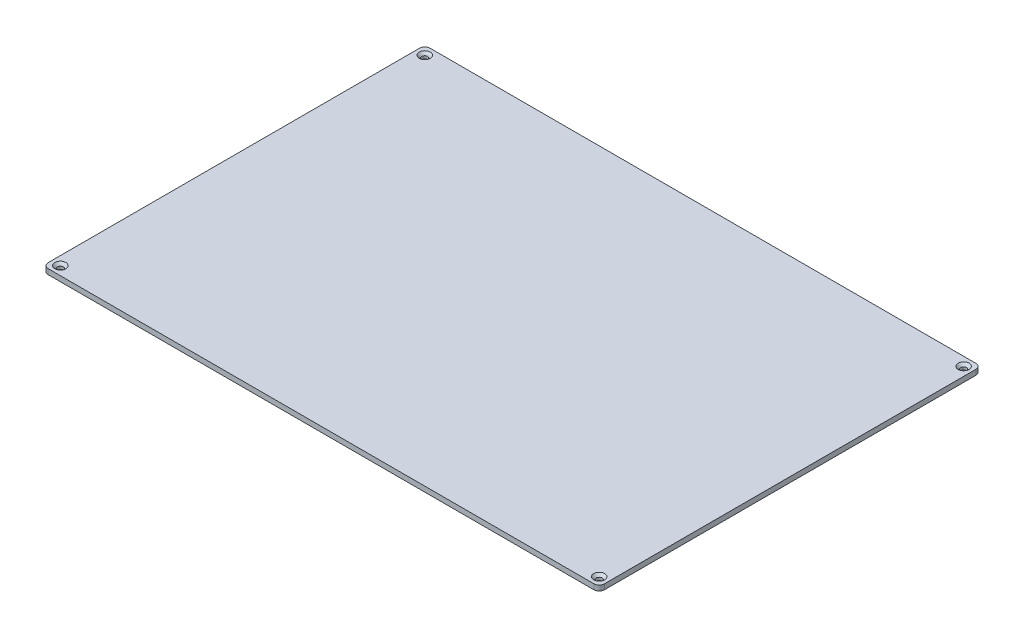
ISO-10303-21;
HEADER;
FILE_DESCRIPTION(('STEP AP214'),'2;1');
FILE_NAME('part.step','',(''),(''),'','','');
FILE_SCHEMA(('AUTOMOTIVE_DESIGN { 1 0 10303 214 1 1 1 1 }'));
ENDSEC;
DATA;
#1=APPLICATION_CONTEXT('core data for automotive mechanical design processes');
#2=APPLICATION_PROTOCOL_DEFINITION('international standard','automotive_design',2000,#1);
#3=PRODUCT_CONTEXT('',#1,'mechanical');
#4=PRODUCT('Part','Part','',(#3));
#5=PRODUCT_RELATED_PRODUCT_CATEGORY('part','',(#4));
#6=PRODUCT_DEFINITION_FORMATION('','',#4);
#7=PRODUCT_DEFINITION_CONTEXT('part definition',#1,'design');
#8=PRODUCT_DEFINITION('design','',#6,#7);
#9=PRODUCT_DEFINITION_SHAPE('','',#8);
#10=(LENGTH_UNIT() NAMED_UNIT(*) SI_UNIT(.MILLI.,.METRE.));
#11=(NAMED_UNIT(*) PLANE_ANGLE_UNIT() SI_UNIT($,.RADIAN.));
#12=(NAMED_UNIT(*) SI_UNIT($,.STERADIAN.) SOLID_ANGLE_UNIT());
#13=UNCERTAINTY_MEASURE_WITH_UNIT(LENGTH_MEASURE(1.E-05),#10,'distance_accuracy_value','');
#14=(GEOMETRIC_REPRESENTATION_CONTEXT(3) GLOBAL_UNCERTAINTY_ASSIGNED_CONTEXT((#13)) GLOBAL_UNIT_ASSIGNED_CONTEXT((#10,
#11,#12)) REPRESENTATION_CONTEXT('',''));
#15=CARTESIAN_POINT('',(0.,0.,0.));
#16=DIRECTION('',(0.,0.,1.));
#17=DIRECTION('',(1.,0.,0.));
#18=AXIS2_PLACEMENT_3D('',#15,#16,#17);
#19=CARTESIAN_POINT('',(156.5,0.,-106.5));
#20=DIRECTION('',(0.,-1.,0.));
#21=DIRECTION('',(0.,0.,-1.));
#22=AXIS2_PLACEMENT_3D('',#19,#20,#21);
#23=PLANE('',#22);
#24=CARTESIAN_POINT('',(-154.5,0.,104.5));
#25=DIRECTION('',(0.,1.,0.));
#26=DIRECTION('',(0.,0.,1.));
#27=AXIS2_PLACEMENT_3D('',#24,#25,#26);
#28=CIRCLE('',#27,1.70000000000001);
#29=CARTESIAN_POINT('',(-154.5,0.,106.2));
#30=VERTEX_POINT('',#29);
#31=EDGE_CURVE('E196',#30,#30,#28,.T.);
#32=ORIENTED_EDGE('',*,*,#31,.T.);
#33=EDGE_LOOP('',(#32));
#34=FACE_BOUND('',#33,.T.);
#35=CARTESIAN_POINT('',(156.5,0.,-106.5));
#36=DIRECTION('',(0.,1.,0.));
#37=DIRECTION('',(0.,0.,-1.));
#38=AXIS2_PLACEMENT_3D('',#35,#36,#37);
#39=CIRCLE('',#38,3.);
#40=CARTESIAN_POINT('',(159.5,0.,-106.5));
#41=VERTEX_POINT('',#40);
#42=CARTESIAN_POINT('',(156.5,0.,-109.5));
#43=VERTEX_POINT('',#42);
#44=EDGE_CURVE('E131',#41,#43,#39,.T.);
#45=ORIENTED_EDGE('',*,*,#44,.F.);
#46=DIRECTION('',(0.,0.,-1.));
#47=VECTOR('',#46,1.);
#48=CARTESIAN_POINT('',(159.5,0.,-106.5));
#49=LINE('',#48,#47);
#50=CARTESIAN_POINT('',(159.5,0.,106.5));
#51=VERTEX_POINT('',#50);
#52=EDGE_CURVE('E86',#51,#41,#49,.T.);
#53=ORIENTED_EDGE('',*,*,#52,.F.);
#54=CARTESIAN_POINT('',(156.5,0.,106.5));
#55=DIRECTION('',(0.,1.,0.));
#56=DIRECTION('',(0.,0.,1.));
#57=AXIS2_PLACEMENT_3D('',#54,#55,#56);
#58=CIRCLE('',#57,3.);
#59=CARTESIAN_POINT('',(156.5,0.,109.5));
#60=VERTEX_POINT('',#59);
#61=EDGE_CURVE('E80',#60,#51,#58,.T.);
#62=ORIENTED_EDGE('',*,*,#61,.F.);
#63=DIRECTION('',(1.,0.,0.));
#64=VECTOR('',#63,1.);
#65=CARTESIAN_POINT('',(-156.5,0.,109.5));
#66=LINE('',#65,#64);
#67=CARTESIAN_POINT('',(-156.5,0.,109.5));
#68=VERTEX_POINT('',#67);
#69=EDGE_CURVE('E121',#68,#60,#66,.T.);
#70=ORIENTED_EDGE('',*,*,#69,.F.);
#71=CARTESIAN_POINT('',(-156.5,0.,106.5));
#72=DIRECTION('',(0.,1.,0.));
#73=DIRECTION('',(0.,0.,1.));
#74=AXIS2_PLACEMENT_3D('',#71,#72,#73);
#75=CIRCLE('',#74,3.);
#76=CARTESIAN_POINT('',(-159.5,0.,106.5));
#77=VERTEX_POINT('',#76);
#78=EDGE_CURVE('E141',#77,#68,#75,.T.);
#79=ORIENTED_EDGE('',*,*,#78,.F.);
#80=DIRECTION('',(0.,0.,1.));
#81=VECTOR('',#80,1.);
#82=CARTESIAN_POINT('',(-159.5,0.,-106.5));
#83=LINE('',#82,#81);
#84=CARTESIAN_POINT('',(-159.5,0.,-106.5));
#85=VERTEX_POINT('',#84);
#86=EDGE_CURVE('E139',#85,#77,#83,.T.);
#87=ORIENTED_EDGE('',*,*,#86,.F.);
#88=CARTESIAN_POINT('',(-156.5,0.,-106.5));
#89=DIRECTION('',(0.,1.,0.));
#90=DIRECTION('',(0.,0.,1.));
#91=AXIS2_PLACEMENT_3D('',#88,#89,#90);
#92=CIRCLE('',#91,3.);
#93=CARTESIAN_POINT('',(-156.5,0.,-109.5));
#94=VERTEX_POINT('',#93);
#95=EDGE_CURVE('E137',#94,#85,#92,.T.);
#96=ORIENTED_EDGE('',*,*,#95,.F.);
#97=DIRECTION('',(-1.,0.,0.));
#98=VECTOR('',#97,1.);
#99=CARTESIAN_POINT('',(-156.5,0.,-109.5));
#100=LINE('',#99,#98);
#101=EDGE_CURVE('E134',#43,#94,#100,.T.);
#102=ORIENTED_EDGE('',*,*,#101,.F.);
#103=EDGE_LOOP('',(#45,#53,#62,#70,#79,#87,#96,#102));
#104=FACE_BOUND('',#103,.T.);
#105=CARTESIAN_POINT('',(154.5,0.,-104.5));
#106=DIRECTION('',(0.,1.,0.));
#107=DIRECTION('',(0.,0.,1.));
#108=AXIS2_PLACEMENT_3D('',#105,#106,#107);
#109=CIRCLE('',#108,1.70000000000001);
#110=CARTESIAN_POINT('',(154.5,0.,-102.8));
#111=VERTEX_POINT('',#110);
#112=EDGE_CURVE('E135',#111,#111,#109,.T.);
#113=ORIENTED_EDGE('',*,*,#112,.T.);
#114=EDGE_LOOP('',(#113));
#115=FACE_BOUND('',#114,.T.);
#116=CARTESIAN_POINT('',(154.5,0.,104.5));
#117=DIRECTION('',(0.,1.,0.));
#118=DIRECTION('',(0.,0.,1.));
#119=AXIS2_PLACEMENT_3D('',#116,#117,#118);
#120=CIRCLE('',#119,1.70000000000001);
#121=CARTESIAN_POINT('',(154.5,0.,106.2));
#122=VERTEX_POINT('',#121);
#123=EDGE_CURVE('E187',#122,#122,#120,.T.);
#124=ORIENTED_EDGE('',*,*,#123,.T.);
#125=EDGE_LOOP('',(#124));
#126=FACE_BOUND('',#125,.T.);
#127=CARTESIAN_POINT('',(-154.5,0.,-104.5));
#128=DIRECTION('',(0.,1.,0.));
#129=DIRECTION('',(0.,0.,1.));
#130=AXIS2_PLACEMENT_3D('',#127,#128,#129);
#131=CIRCLE('',#130,1.70000000000001);
#132=CARTESIAN_POINT('',(-154.5,0.,-102.8));
#133=VERTEX_POINT('',#132);
#134=EDGE_CURVE('E205',#133,#133,#131,.T.);
#135=ORIENTED_EDGE('',*,*,#134,.T.);
#136=EDGE_LOOP('',(#135));
#137=FACE_BOUND('',#136,.T.);
#138=ADVANCED_FACE('F34',(#34,#104,#115,#126,#137),#23,.T.);
#139=CARTESIAN_POINT('',(156.5,3.,-106.5));
#140=DIRECTION('',(0.,-1.,0.));
#141=DIRECTION('',(0.,0.,-1.));
#142=AXIS2_PLACEMENT_3D('',#139,#140,#141);
#143=CYLINDRICAL_SURFACE('',#142,3.);
#144=ORIENTED_EDGE('',*,*,#44,.T.);
#145=DIRECTION('',(0.,-1.,0.));
#146=VECTOR('',#145,1.);
#147=CARTESIAN_POINT('',(156.5,3.,-109.5));
#148=LINE('',#147,#146);
#149=CARTESIAN_POINT('',(156.5,3.,-109.5));
#150=VERTEX_POINT('',#149);
#151=EDGE_CURVE('E11',#150,#43,#148,.T.);
#152=ORIENTED_EDGE('',*,*,#151,.F.);
#153=CARTESIAN_POINT('',(156.5,3.,-106.5));
#154=DIRECTION('',(0.,1.,0.));
#155=DIRECTION('',(0.,0.,-1.));
#156=AXIS2_PLACEMENT_3D('',#153,#154,#155);
#157=CIRCLE('',#156,3.);
#158=CARTESIAN_POINT('',(159.5,3.,-106.5));
#159=VERTEX_POINT('',#158);
#160=EDGE_CURVE('E146',#159,#150,#157,.T.);
#161=ORIENTED_EDGE('',*,*,#160,.F.);
#162=DIRECTION('',(0.,-1.,0.));
#163=VECTOR('',#162,1.);
#164=CARTESIAN_POINT('',(159.5,3.,-106.5));
#165=LINE('',#164,#163);
#166=EDGE_CURVE('E127',#159,#41,#165,.T.);
#167=ORIENTED_EDGE('',*,*,#166,.T.);
#168=EDGE_LOOP('',(#144,#152,#161,#167));
#169=FACE_BOUND('',#168,.T.);
#170=ADVANCED_FACE('F36',(#169),#143,.T.);
#171=CARTESIAN_POINT('',(-156.5,3.,-109.5));
#172=DIRECTION('',(0.,0.,1.));
#173=DIRECTION('',(1.,0.,0.));
#174=AXIS2_PLACEMENT_3D('',#171,#172,#173);
#175=PLANE('',#174);
#176=ORIENTED_EDGE('',*,*,#101,.T.);
#177=DIRECTION('',(0.,-1.,0.));
#178=VECTOR('',#177,1.);
#179=CARTESIAN_POINT('',(-156.5,3.,-109.5));
#180=LINE('',#179,#178);
#181=CARTESIAN_POINT('',(-156.5,3.,-109.5));
#182=VERTEX_POINT('',#181);
#183=EDGE_CURVE('E43',#182,#94,#180,.T.);
#184=ORIENTED_EDGE('',*,*,#183,.F.);
#185=DIRECTION('',(-1.,0.,0.));
#186=VECTOR('',#185,1.);
#187=CARTESIAN_POINT('',(-156.5,3.,-109.5));
#188=LINE('',#187,#186);
#189=EDGE_CURVE('E94',#150,#182,#188,.T.);
#190=ORIENTED_EDGE('',*,*,#189,.F.);
#191=ORIENTED_EDGE('',*,*,#151,.T.);
#192=EDGE_LOOP('',(#176,#184,#190,#191));
#193=FACE_BOUND('',#192,.T.);
#194=ADVANCED_FACE('F249',(#193),#175,.F.);
#195=CARTESIAN_POINT('',(-156.5,3.,-106.5));
#196=DIRECTION('',(0.,-1.,0.));
#197=DIRECTION('',(0.,0.,-1.));
#198=AXIS2_PLACEMENT_3D('',#195,#196,#197);
#199=CYLINDRICAL_SURFACE('',#198,3.);
#200=ORIENTED_EDGE('',*,*,#95,.T.);
#201=DIRECTION('',(0.,-1.,0.));
#202=VECTOR('',#201,1.);
#203=CARTESIAN_POINT('',(-159.5,3.,-106.5));
#204=LINE('',#203,#202);
#205=CARTESIAN_POINT('',(-159.5,3.,-106.5));
#206=VERTEX_POINT('',#205);
#207=EDGE_CURVE('E153',#206,#85,#204,.T.);
#208=ORIENTED_EDGE('',*,*,#207,.F.);
#209=CARTESIAN_POINT('',(-156.5,3.,-106.5));
#210=DIRECTION('',(0.,1.,0.));
#211=DIRECTION('',(0.,0.,1.));
#212=AXIS2_PLACEMENT_3D('',#209,#210,#211);
#213=CIRCLE('',#212,3.);
#214=EDGE_CURVE('E161',#182,#206,#213,.T.);
#215=ORIENTED_EDGE('',*,*,#214,.F.);
#216=ORIENTED_EDGE('',*,*,#183,.T.);
#217=EDGE_LOOP('',(#200,#208,#215,#216));
#218=FACE_BOUND('',#217,.T.);
#219=ADVANCED_FACE('F159',(#218),#199,.T.);
#220=CARTESIAN_POINT('',(-159.5,3.,-106.5));
#221=DIRECTION('',(1.,0.,0.));
#222=DIRECTION('',(0.,0.,-1.));
#223=AXIS2_PLACEMENT_3D('',#220,#221,#222);
#224=PLANE('',#223);
#225=ORIENTED_EDGE('',*,*,#86,.T.);
#226=DIRECTION('',(0.,-1.,0.));
#227=VECTOR('',#226,1.);
#228=CARTESIAN_POINT('',(-159.5,3.,106.5));
#229=LINE('',#228,#227);
#230=CARTESIAN_POINT('',(-159.5,3.,106.5));
#231=VERTEX_POINT('',#230);
#232=EDGE_CURVE('E150',#231,#77,#229,.T.);
#233=ORIENTED_EDGE('',*,*,#232,.F.);
#234=DIRECTION('',(0.,0.,1.));
#235=VECTOR('',#234,1.);
#236=CARTESIAN_POINT('',(-159.5,3.,-106.5));
#237=LINE('',#236,#235);
#238=EDGE_CURVE('E173',#206,#231,#237,.T.);
#239=ORIENTED_EDGE('',*,*,#238,.F.);
#240=ORIENTED_EDGE('',*,*,#207,.T.);
#241=EDGE_LOOP('',(#225,#233,#239,#240));
#242=FACE_BOUND('',#241,.T.);
#243=ADVANCED_FACE('F169',(#242),#224,.F.);
#244=CARTESIAN_POINT('',(-156.5,3.,106.5));
#245=DIRECTION('',(0.,-1.,0.));
#246=DIRECTION('',(0.,0.,-1.));
#247=AXIS2_PLACEMENT_3D('',#244,#245,#246);
#248=CYLINDRICAL_SURFACE('',#247,3.);
#249=ORIENTED_EDGE('',*,*,#78,.T.);
#250=DIRECTION('',(0.,-1.,0.));
#251=VECTOR('',#250,1.);
#252=CARTESIAN_POINT('',(-156.5,3.,109.5));
#253=LINE('',#252,#251);
#254=CARTESIAN_POINT('',(-156.5,3.,109.5));
#255=VERTEX_POINT('',#254);
#256=EDGE_CURVE('E122',#255,#68,#253,.T.);
#257=ORIENTED_EDGE('',*,*,#256,.F.);
#258=CARTESIAN_POINT('',(-156.5,3.,106.5));
#259=DIRECTION('',(0.,1.,0.));
#260=DIRECTION('',(0.,0.,1.));
#261=AXIS2_PLACEMENT_3D('',#258,#259,#260);
#262=CIRCLE('',#261,3.);
#263=EDGE_CURVE('E113',#231,#255,#262,.T.);
#264=ORIENTED_EDGE('',*,*,#263,.F.);
#265=ORIENTED_EDGE('',*,*,#232,.T.);
#266=EDGE_LOOP('',(#249,#257,#264,#265));
#267=FACE_BOUND('',#266,.T.);
#268=ADVANCED_FACE('F172',(#267),#248,.T.);
#269=CARTESIAN_POINT('',(-156.5,3.,109.5));
#270=DIRECTION('',(0.,0.,-1.));
#271=DIRECTION('',(-1.,0.,0.));
#272=AXIS2_PLACEMENT_3D('',#269,#270,#271);
#273=PLANE('',#272);
#274=ORIENTED_EDGE('',*,*,#69,.T.);
#275=DIRECTION('',(0.,-1.,0.));
#276=VECTOR('',#275,1.);
#277=CARTESIAN_POINT('',(156.5,3.,109.5));
#278=LINE('',#277,#276);
#279=CARTESIAN_POINT('',(156.5,3.,109.5));
#280=VERTEX_POINT('',#279);
#281=EDGE_CURVE('E118',#280,#60,#278,.T.);
#282=ORIENTED_EDGE('',*,*,#281,.F.);
#283=DIRECTION('',(1.,0.,0.));
#284=VECTOR('',#283,1.);
#285=CARTESIAN_POINT('',(-156.5,3.,109.5));
#286=LINE('',#285,#284);
#287=EDGE_CURVE('E107',#255,#280,#286,.T.);
#288=ORIENTED_EDGE('',*,*,#287,.F.);
#289=ORIENTED_EDGE('',*,*,#256,.T.);
#290=EDGE_LOOP('',(#274,#282,#288,#289));
#291=FACE_BOUND('',#290,.T.);
#292=ADVANCED_FACE('F119',(#291),#273,.F.);
#293=CARTESIAN_POINT('',(156.5,3.,106.5));
#294=DIRECTION('',(0.,-1.,0.));
#295=DIRECTION('',(0.,0.,-1.));
#296=AXIS2_PLACEMENT_3D('',#293,#294,#295);
#297=CYLINDRICAL_SURFACE('',#296,3.);
#298=ORIENTED_EDGE('',*,*,#61,.T.);
#299=DIRECTION('',(0.,-1.,0.));
#300=VECTOR('',#299,1.);
#301=CARTESIAN_POINT('',(159.5,3.,106.5));
#302=LINE('',#301,#300);
#303=CARTESIAN_POINT('',(159.5,3.,106.5));
#304=VERTEX_POINT('',#303);
#305=EDGE_CURVE('E123',#304,#51,#302,.T.);
#306=ORIENTED_EDGE('',*,*,#305,.F.);
#307=CARTESIAN_POINT('',(156.5,3.,106.5));
#308=DIRECTION('',(0.,1.,0.));
#309=DIRECTION('',(0.,0.,1.));
#310=AXIS2_PLACEMENT_3D('',#307,#308,#309);
#311=CIRCLE('',#310,3.);
#312=EDGE_CURVE('E111',#280,#304,#311,.T.);
#313=ORIENTED_EDGE('',*,*,#312,.F.);
#314=ORIENTED_EDGE('',*,*,#281,.T.);
#315=EDGE_LOOP('',(#298,#306,#313,#314));
#316=FACE_BOUND('',#315,.T.);
#317=ADVANCED_FACE('F125',(#316),#297,.T.);
#318=CARTESIAN_POINT('',(159.5,3.,-106.5));
#319=DIRECTION('',(-1.,0.,0.));
#320=DIRECTION('',(0.,0.,1.));
#321=AXIS2_PLACEMENT_3D('',#318,#319,#320);
#322=PLANE('',#321);
#323=ORIENTED_EDGE('',*,*,#52,.T.);
#324=ORIENTED_EDGE('',*,*,#166,.F.);
#325=DIRECTION('',(0.,0.,-1.));
#326=VECTOR('',#325,1.);
#327=CARTESIAN_POINT('',(159.5,3.,-106.5));
#328=LINE('',#327,#326);
#329=EDGE_CURVE('E51',#304,#159,#328,.T.);
#330=ORIENTED_EDGE('',*,*,#329,.F.);
#331=ORIENTED_EDGE('',*,*,#305,.T.);
#332=EDGE_LOOP('',(#323,#324,#330,#331));
#333=FACE_BOUND('',#332,.T.);
#334=ADVANCED_FACE('F220',(#333),#322,.F.);
#335=CARTESIAN_POINT('',(156.5,3.,-106.5));
#336=DIRECTION('',(0.,-1.,0.));
#337=DIRECTION('',(0.,0.,-1.));
#338=AXIS2_PLACEMENT_3D('',#335,#336,#337);
#339=PLANE('',#338);
#340=CARTESIAN_POINT('',(-154.5,3.,-104.5));
#341=DIRECTION('',(0.,1.,0.));
#342=DIRECTION('',(0.,0.,1.));
#343=AXIS2_PLACEMENT_3D('',#340,#341,#342);
#344=CIRCLE('',#343,3.15000000000001);
#345=CARTESIAN_POINT('',(-154.5,3.,-101.35));
#346=VERTEX_POINT('',#345);
#347=EDGE_CURVE('E211',#346,#346,#344,.T.);
#348=ORIENTED_EDGE('',*,*,#347,.F.);
#349=EDGE_LOOP('',(#348));
#350=FACE_BOUND('',#349,.T.);
#351=CARTESIAN_POINT('',(-154.5,3.,104.5));
#352=DIRECTION('',(0.,1.,0.));
#353=DIRECTION('',(0.,0.,1.));
#354=AXIS2_PLACEMENT_3D('',#351,#352,#353);
#355=CIRCLE('',#354,3.14999999999999);
#356=CARTESIAN_POINT('',(-154.5,3.,107.65));
#357=VERTEX_POINT('',#356);
#358=EDGE_CURVE('E202',#357,#357,#355,.T.);
#359=ORIENTED_EDGE('',*,*,#358,.F.);
#360=EDGE_LOOP('',(#359));
#361=FACE_BOUND('',#360,.T.);
#362=CARTESIAN_POINT('',(154.5,3.,104.5));
#363=DIRECTION('',(0.,1.,0.));
#364=DIRECTION('',(0.,0.,1.));
#365=AXIS2_PLACEMENT_3D('',#362,#363,#364);
#366=CIRCLE('',#365,3.14999999999999);
#367=CARTESIAN_POINT('',(154.5,3.,107.65));
#368=VERTEX_POINT('',#367);
#369=EDGE_CURVE('E193',#368,#368,#366,.T.);
#370=ORIENTED_EDGE('',*,*,#369,.F.);
#371=EDGE_LOOP('',(#370));
#372=FACE_BOUND('',#371,.T.);
#373=CARTESIAN_POINT('',(154.5,3.,-104.5));
#374=DIRECTION('',(0.,1.,0.));
#375=DIRECTION('',(0.,0.,1.));
#376=AXIS2_PLACEMENT_3D('',#373,#374,#375);
#377=CIRCLE('',#376,3.15000000000001);
#378=CARTESIAN_POINT('',(154.5,3.,-101.35));
#379=VERTEX_POINT('',#378);
#380=EDGE_CURVE('E184',#379,#379,#377,.T.);
#381=ORIENTED_EDGE('',*,*,#380,.F.);
#382=EDGE_LOOP('',(#381));
#383=FACE_BOUND('',#382,.T.);
#384=ORIENTED_EDGE('',*,*,#160,.T.);
#385=ORIENTED_EDGE('',*,*,#189,.T.);
#386=ORIENTED_EDGE('',*,*,#214,.T.);
#387=ORIENTED_EDGE('',*,*,#238,.T.);
#388=ORIENTED_EDGE('',*,*,#263,.T.);
#389=ORIENTED_EDGE('',*,*,#287,.T.);
#390=ORIENTED_EDGE('',*,*,#312,.T.);
#391=ORIENTED_EDGE('',*,*,#329,.T.);
#392=EDGE_LOOP('',(#384,#385,#386,#387,#388,#389,#390,#391));
#393=FACE_BOUND('',#392,.T.);
#394=ADVANCED_FACE('F109',(#350,#361,#372,#383,#393),#339,.F.);
#395=CARTESIAN_POINT('',(154.5,3.,-104.5));
#396=DIRECTION('',(0.,1.,0.));
#397=DIRECTION('',(0.,0.,1.));
#398=AXIS2_PLACEMENT_3D('',#395,#396,#397);
#399=CYLINDRICAL_SURFACE('',#398,1.70000000000001);
#400=ORIENTED_EDGE('',*,*,#112,.F.);
#401=EDGE_LOOP('',(#400));
#402=FACE_BOUND('',#401,.T.);
#403=CARTESIAN_POINT('',(154.5,1.55,-104.5));
#404=DIRECTION('',(0.,1.,0.));
#405=DIRECTION('',(0.,0.,1.));
#406=AXIS2_PLACEMENT_3D('',#403,#404,#405);
#407=CIRCLE('',#406,1.70000000000001);
#408=CARTESIAN_POINT('',(154.5,1.55,-102.8));
#409=VERTEX_POINT('',#408);
#410=EDGE_CURVE('E181',#409,#409,#407,.T.);
#411=ORIENTED_EDGE('',*,*,#410,.T.);
#412=EDGE_LOOP('',(#411));
#413=FACE_BOUND('',#412,.T.);
#414=ADVANCED_FACE('F219',(#402,#413),#399,.F.);
#415=CARTESIAN_POINT('',(154.5,3.,-104.5));
#416=DIRECTION('',(0.,1.,0.));
#417=DIRECTION('',(0.,0.,1.));
#418=AXIS2_PLACEMENT_3D('',#415,#416,#417);
#419=CONICAL_SURFACE('',#418,3.15000000000001,0.78539816339745);
#420=ORIENTED_EDGE('',*,*,#410,.F.);
#421=EDGE_LOOP('',(#420));
#422=FACE_BOUND('',#421,.T.);
#423=ORIENTED_EDGE('',*,*,#380,.T.);
#424=EDGE_LOOP('',(#423));
#425=FACE_BOUND('',#424,.T.);
#426=ADVANCED_FACE('F228',(#422,#425),#419,.F.);
#427=CARTESIAN_POINT('',(154.5,3.,104.5));
#428=DIRECTION('',(0.,1.,0.));
#429=DIRECTION('',(0.,0.,1.));
#430=AXIS2_PLACEMENT_3D('',#427,#428,#429);
#431=CYLINDRICAL_SURFACE('',#430,1.70000000000001);
#432=ORIENTED_EDGE('',*,*,#123,.F.);
#433=EDGE_LOOP('',(#432));
#434=FACE_BOUND('',#433,.T.);
#435=CARTESIAN_POINT('',(154.5,1.55,104.5));
#436=DIRECTION('',(0.,1.,0.));
#437=DIRECTION('',(0.,0.,1.));
#438=AXIS2_PLACEMENT_3D('',#435,#436,#437);
#439=CIRCLE('',#438,1.70000000000001);
#440=CARTESIAN_POINT('',(154.5,1.55,106.2));
#441=VERTEX_POINT('',#440);
#442=EDGE_CURVE('E190',#441,#441,#439,.T.);
#443=ORIENTED_EDGE('',*,*,#442,.T.);
#444=EDGE_LOOP('',(#443));
#445=FACE_BOUND('',#444,.T.);
#446=ADVANCED_FACE('F230',(#434,#445),#431,.F.);
#447=CARTESIAN_POINT('',(154.5,3.,104.5));
#448=DIRECTION('',(0.,1.,0.));
#449=DIRECTION('',(0.,0.,1.));
#450=AXIS2_PLACEMENT_3D('',#447,#448,#449);
#451=CONICAL_SURFACE('',#450,3.14999999999999,0.785398163397441);
#452=ORIENTED_EDGE('',*,*,#442,.F.);
#453=EDGE_LOOP('',(#452));
#454=FACE_BOUND('',#453,.T.);
#455=ORIENTED_EDGE('',*,*,#369,.T.);
#456=EDGE_LOOP('',(#455));
#457=FACE_BOUND('',#456,.T.);
#458=ADVANCED_FACE('F237',(#454,#457),#451,.F.);
#459=CARTESIAN_POINT('',(-154.5,3.,104.5));
#460=DIRECTION('',(0.,1.,0.));
#461=DIRECTION('',(0.,0.,1.));
#462=AXIS2_PLACEMENT_3D('',#459,#460,#461);
#463=CYLINDRICAL_SURFACE('',#462,1.70000000000001);
#464=ORIENTED_EDGE('',*,*,#31,.F.);
#465=EDGE_LOOP('',(#464));
#466=FACE_BOUND('',#465,.T.);
#467=CARTESIAN_POINT('',(-154.5,1.55,104.5));
#468=DIRECTION('',(0.,1.,0.));
#469=DIRECTION('',(0.,0.,1.));
#470=AXIS2_PLACEMENT_3D('',#467,#468,#469);
#471=CIRCLE('',#470,1.70000000000001);
#472=CARTESIAN_POINT('',(-154.5,1.55,106.2));
#473=VERTEX_POINT('',#472);
#474=EDGE_CURVE('E199',#473,#473,#471,.T.);
#475=ORIENTED_EDGE('',*,*,#474,.T.);
#476=EDGE_LOOP('',(#475));
#477=FACE_BOUND('',#476,.T.);
#478=ADVANCED_FACE('F322',(#466,#477),#463,.F.);
#479=CARTESIAN_POINT('',(-154.5,3.,104.5));
#480=DIRECTION('',(0.,1.,0.));
#481=DIRECTION('',(0.,0.,1.));
#482=AXIS2_PLACEMENT_3D('',#479,#480,#481);
#483=CONICAL_SURFACE('',#482,3.14999999999999,0.785398163397441);
#484=ORIENTED_EDGE('',*,*,#474,.F.);
#485=EDGE_LOOP('',(#484));
#486=FACE_BOUND('',#485,.T.);
#487=ORIENTED_EDGE('',*,*,#358,.T.);
#488=EDGE_LOOP('',(#487));
#489=FACE_BOUND('',#488,.T.);
#490=ADVANCED_FACE('F332',(#486,#489),#483,.F.);
#491=CARTESIAN_POINT('',(-154.5,3.,-104.5));
#492=DIRECTION('',(0.,1.,0.));
#493=DIRECTION('',(0.,0.,1.));
#494=AXIS2_PLACEMENT_3D('',#491,#492,#493);
#495=CYLINDRICAL_SURFACE('',#494,1.70000000000001);
#496=ORIENTED_EDGE('',*,*,#134,.F.);
#497=EDGE_LOOP('',(#496));
#498=FACE_BOUND('',#497,.T.);
#499=CARTESIAN_POINT('',(-154.5,1.55,-104.5));
#500=DIRECTION('',(0.,1.,0.));
#501=DIRECTION('',(0.,0.,1.));
#502=AXIS2_PLACEMENT_3D('',#499,#500,#501);
#503=CIRCLE('',#502,1.70000000000001);
#504=CARTESIAN_POINT('',(-154.5,1.55,-102.8));
#505=VERTEX_POINT('',#504);
#506=EDGE_CURVE('E208',#505,#505,#503,.T.);
#507=ORIENTED_EDGE('',*,*,#506,.T.);
#508=EDGE_LOOP('',(#507));
#509=FACE_BOUND('',#508,.T.);
#510=ADVANCED_FACE('F342',(#498,#509),#495,.F.);
#511=CARTESIAN_POINT('',(-154.5,3.,-104.5));
#512=DIRECTION('',(0.,1.,0.));
#513=DIRECTION('',(0.,0.,1.));
#514=AXIS2_PLACEMENT_3D('',#511,#512,#513);
#515=CONICAL_SURFACE('',#514,3.15000000000001,0.78539816339745);
#516=ORIENTED_EDGE('',*,*,#506,.F.);
#517=EDGE_LOOP('',(#516));
#518=FACE_BOUND('',#517,.T.);
#519=ORIENTED_EDGE('',*,*,#347,.T.);
#520=EDGE_LOOP('',(#519));
#521=FACE_BOUND('',#520,.T.);
#522=ADVANCED_FACE('F215',(#518,#521),#515,.F.);
#523=CLOSED_SHELL('',(#138,#170,#194,#219,#243,#268,#292,#317,#334,#394,#414,#426,#446,#458,
#478,#490,#510,#522));
#524=MANIFOLD_SOLID_BREP('B2',#523);
#525=ADVANCED_BREP_SHAPE_REPRESENTATION('',(#18,#524),#14);
#526=SHAPE_DEFINITION_REPRESENTATION(#9,#525);
ENDSEC;
END-ISO-10303-21;
